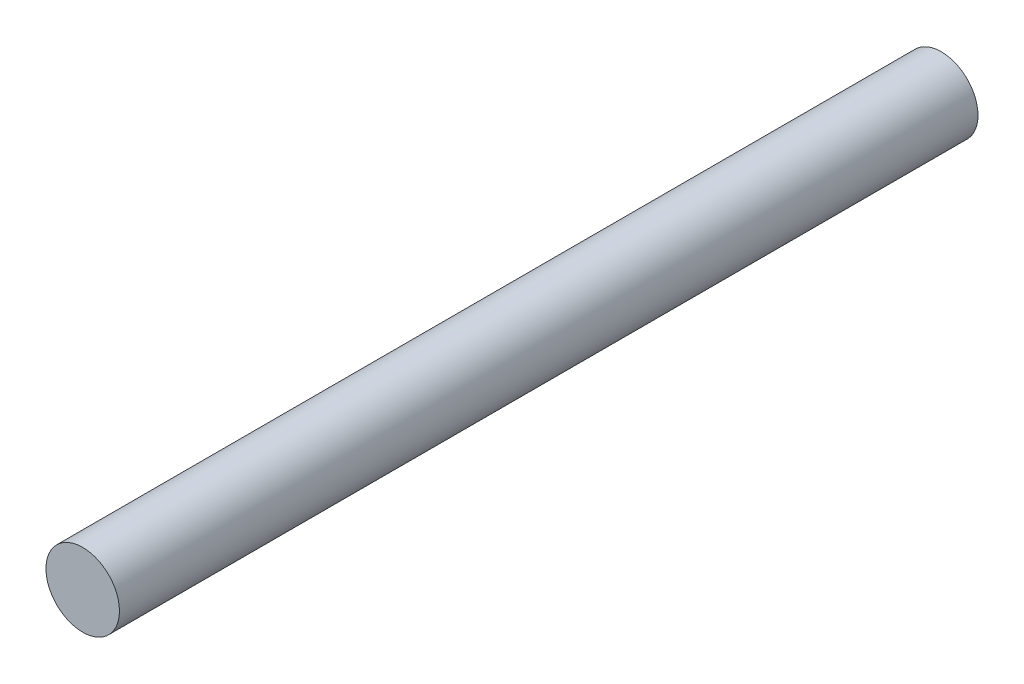
ISO-10303-21;
HEADER;
FILE_DESCRIPTION(('STEP AP214'),'2;1');
FILE_NAME('part.step','',(''),(''),'','','');
FILE_SCHEMA(('AUTOMOTIVE_DESIGN { 1 0 10303 214 1 1 1 1 }'));
ENDSEC;
DATA;
#1=APPLICATION_CONTEXT('core data for automotive mechanical design processes');
#2=APPLICATION_PROTOCOL_DEFINITION('international standard','automotive_design',2000,#1);
#3=PRODUCT_CONTEXT('',#1,'mechanical');
#4=PRODUCT('Part','Part','',(#3));
#5=PRODUCT_RELATED_PRODUCT_CATEGORY('part','',(#4));
#6=PRODUCT_DEFINITION_FORMATION('','',#4);
#7=PRODUCT_DEFINITION_CONTEXT('part definition',#1,'design');
#8=PRODUCT_DEFINITION('design','',#6,#7);
#9=PRODUCT_DEFINITION_SHAPE('','',#8);
#10=(LENGTH_UNIT() NAMED_UNIT(*) SI_UNIT(.MILLI.,.METRE.));
#11=(NAMED_UNIT(*) PLANE_ANGLE_UNIT() SI_UNIT($,.RADIAN.));
#12=(NAMED_UNIT(*) SI_UNIT($,.STERADIAN.) SOLID_ANGLE_UNIT());
#13=UNCERTAINTY_MEASURE_WITH_UNIT(LENGTH_MEASURE(1.E-05),#10,'distance_accuracy_value','');
#14=(GEOMETRIC_REPRESENTATION_CONTEXT(3) GLOBAL_UNCERTAINTY_ASSIGNED_CONTEXT((#13)) GLOBAL_UNIT_ASSIGNED_CONTEXT((#10,
#11,#12)) REPRESENTATION_CONTEXT('',''));
#15=CARTESIAN_POINT('',(0.,0.,0.));
#16=DIRECTION('',(0.,0.,1.));
#17=DIRECTION('',(1.,0.,0.));
#18=AXIS2_PLACEMENT_3D('',#15,#16,#17);
#19=CARTESIAN_POINT('',(0.,0.,55.626));
#20=DIRECTION('',(0.,0.,-1.));
#21=DIRECTION('',(-1.,0.,0.));
#22=AXIS2_PLACEMENT_3D('',#19,#20,#21);
#23=CYLINDRICAL_SURFACE('',#22,2.38125);
#24=CARTESIAN_POINT('',(0.,0.,55.626));
#25=DIRECTION('',(0.,0.,1.));
#26=DIRECTION('',(1.,0.,0.));
#27=AXIS2_PLACEMENT_3D('',#24,#25,#26);
#28=CIRCLE('',#27,2.38125);
#29=CARTESIAN_POINT('',(2.38125,0.,55.626));
#30=VERTEX_POINT('',#29);
#31=EDGE_CURVE('E10',#30,#30,#28,.T.);
#32=ORIENTED_EDGE('',*,*,#31,.F.);
#33=EDGE_LOOP('',(#32));
#34=FACE_BOUND('',#33,.T.);
#35=CARTESIAN_POINT('',(0.,0.,0.));
#36=DIRECTION('',(0.,0.,1.));
#37=DIRECTION('',(1.,0.,0.));
#38=AXIS2_PLACEMENT_3D('',#35,#36,#37);
#39=CIRCLE('',#38,2.38125);
#40=CARTESIAN_POINT('',(2.38125,0.,0.));
#41=VERTEX_POINT('',#40);
#42=EDGE_CURVE('E40',#41,#41,#39,.T.);
#43=ORIENTED_EDGE('',*,*,#42,.T.);
#44=EDGE_LOOP('',(#43));
#45=FACE_BOUND('',#44,.T.);
#46=ADVANCED_FACE('F37',(#34,#45),#23,.T.);
#47=CARTESIAN_POINT('',(0.,0.,55.626));
#48=DIRECTION('',(0.,0.,1.));
#49=DIRECTION('',(1.,0.,0.));
#50=AXIS2_PLACEMENT_3D('',#47,#48,#49);
#51=PLANE('',#50);
#52=ORIENTED_EDGE('',*,*,#31,.T.);
#53=EDGE_LOOP('',(#52));
#54=FACE_BOUND('',#53,.T.);
#55=ADVANCED_FACE('F52',(#54),#51,.T.);
#56=CARTESIAN_POINT('',(0.,0.,0.));
#57=DIRECTION('',(0.,0.,1.));
#58=DIRECTION('',(1.,0.,0.));
#59=AXIS2_PLACEMENT_3D('',#56,#57,#58);
#60=PLANE('',#59);
#61=ORIENTED_EDGE('',*,*,#42,.F.);
#62=EDGE_LOOP('',(#61));
#63=FACE_BOUND('',#62,.T.);
#64=ADVANCED_FACE('F50',(#63),#60,.F.);
#65=CLOSED_SHELL('',(#46,#55,#64));
#66=MANIFOLD_SOLID_BREP('B2',#65);
#67=ADVANCED_BREP_SHAPE_REPRESENTATION('',(#18,#66),#14);
#68=SHAPE_DEFINITION_REPRESENTATION(#9,#67);
ENDSEC;
END-ISO-10303-21;
